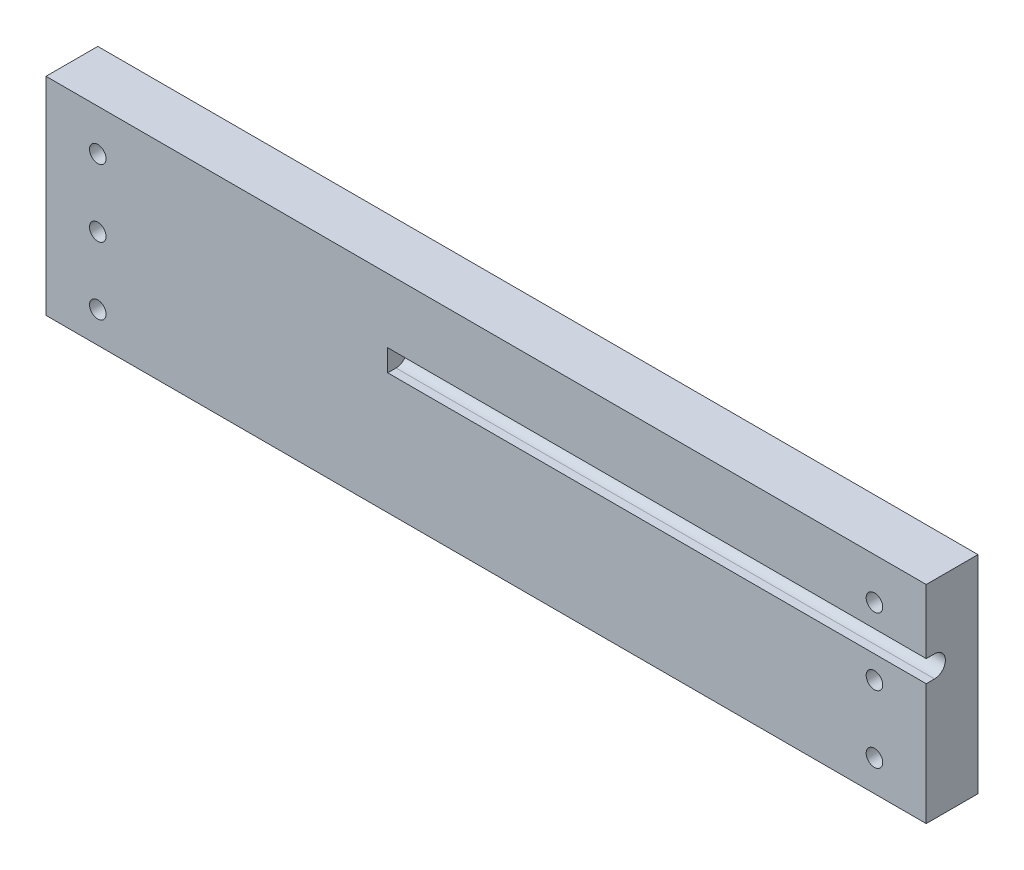
ISO-10303-21;
HEADER;
FILE_DESCRIPTION(('STEP AP214'),'2;1');
FILE_NAME('part.step','',(''),(''),'','','');
FILE_SCHEMA(('AUTOMOTIVE_DESIGN { 1 0 10303 214 1 1 1 1 }'));
ENDSEC;
DATA;
#1=APPLICATION_CONTEXT('core data for automotive mechanical design processes');
#2=APPLICATION_PROTOCOL_DEFINITION('international standard','automotive_design',2000,#1);
#3=PRODUCT_CONTEXT('',#1,'mechanical');
#4=PRODUCT('Part','Part','',(#3));
#5=PRODUCT_RELATED_PRODUCT_CATEGORY('part','',(#4));
#6=PRODUCT_DEFINITION_FORMATION('','',#4);
#7=PRODUCT_DEFINITION_CONTEXT('part definition',#1,'design');
#8=PRODUCT_DEFINITION('design','',#6,#7);
#9=PRODUCT_DEFINITION_SHAPE('','',#8);
#10=(LENGTH_UNIT() NAMED_UNIT(*) SI_UNIT(.MILLI.,.METRE.));
#11=(NAMED_UNIT(*) PLANE_ANGLE_UNIT() SI_UNIT($,.RADIAN.));
#12=(NAMED_UNIT(*) SI_UNIT($,.STERADIAN.) SOLID_ANGLE_UNIT());
#13=UNCERTAINTY_MEASURE_WITH_UNIT(LENGTH_MEASURE(1.E-05),#10,'distance_accuracy_value','');
#14=(GEOMETRIC_REPRESENTATION_CONTEXT(3) GLOBAL_UNCERTAINTY_ASSIGNED_CONTEXT((#13)) GLOBAL_UNIT_ASSIGNED_CONTEXT((#10,
#11,#12)) REPRESENTATION_CONTEXT('',''));
#15=CARTESIAN_POINT('',(0.,0.,0.));
#16=DIRECTION('',(0.,0.,1.));
#17=DIRECTION('',(1.,0.,0.));
#18=AXIS2_PLACEMENT_3D('',#15,#16,#17);
#19=CARTESIAN_POINT('',(-19.,25.5,8.4));
#20=DIRECTION('',(1.,0.,0.));
#21=DIRECTION('',(0.,0.,-1.));
#22=AXIS2_PLACEMENT_3D('',#19,#20,#21);
#23=CYLINDRICAL_SURFACE('',#22,2.1);
#24=CARTESIAN_POINT('',(85.,25.5,8.4));
#25=DIRECTION('',(-1.,0.,0.));
#26=DIRECTION('',(0.,0.,1.));
#27=AXIS2_PLACEMENT_3D('',#24,#25,#26);
#28=CIRCLE('',#27,2.1);
#29=CARTESIAN_POINT('',(85.,27.6,8.4));
#30=VERTEX_POINT('',#29);
#31=CARTESIAN_POINT('',(85.,23.4,8.4));
#32=VERTEX_POINT('',#31);
#33=EDGE_CURVE('E43',#30,#32,#28,.T.);
#34=ORIENTED_EDGE('',*,*,#33,.F.);
#35=DIRECTION('',(1.,0.,0.));
#36=VECTOR('',#35,1.);
#37=CARTESIAN_POINT('',(-23.4944410108488,27.6,8.4));
#38=LINE('',#37,#36);
#39=CARTESIAN_POINT('',(-19.,27.6,8.4));
#40=VERTEX_POINT('',#39);
#41=EDGE_CURVE('E276',#40,#30,#38,.T.);
#42=ORIENTED_EDGE('',*,*,#41,.F.);
#43=CARTESIAN_POINT('',(-19.,25.5,8.4));
#44=DIRECTION('',(1.,0.,0.));
#45=DIRECTION('',(0.,0.,-1.));
#46=AXIS2_PLACEMENT_3D('',#43,#44,#45);
#47=CIRCLE('',#46,2.1);
#48=CARTESIAN_POINT('',(-19.,23.4,8.4));
#49=VERTEX_POINT('',#48);
#50=EDGE_CURVE('E271',#49,#40,#47,.T.);
#51=ORIENTED_EDGE('',*,*,#50,.F.);
#52=DIRECTION('',(1.,0.,0.));
#53=VECTOR('',#52,1.);
#54=CARTESIAN_POINT('',(-23.4944410108488,23.4,8.4));
#55=LINE('',#54,#53);
#56=EDGE_CURVE('E115',#49,#32,#55,.T.);
#57=ORIENTED_EDGE('',*,*,#56,.T.);
#58=EDGE_LOOP('',(#34,#42,#51,#57));
#59=FACE_BOUND('',#58,.T.);
#60=ADVANCED_FACE('F35',(#59),#23,.F.);
#61=CARTESIAN_POINT('',(-85.,0.,10.));
#62=DIRECTION('',(0.,0.,1.));
#63=DIRECTION('',(1.,0.,0.));
#64=AXIS2_PLACEMENT_3D('',#61,#62,#63);
#65=PLANE('',#64);
#66=DIRECTION('',(1.,0.,0.));
#67=VECTOR('',#66,1.);
#68=CARTESIAN_POINT('',(-23.4944410108488,23.4,10.));
#69=LINE('',#68,#67);
#70=CARTESIAN_POINT('',(-19.,23.4,10.));
#71=VERTEX_POINT('',#70);
#72=CARTESIAN_POINT('',(85.,23.4,10.));
#73=VERTEX_POINT('',#72);
#74=EDGE_CURVE('E109',#71,#73,#69,.T.);
#75=ORIENTED_EDGE('',*,*,#74,.F.);
#76=DIRECTION('',(0.,1.,0.));
#77=VECTOR('',#76,1.);
#78=CARTESIAN_POINT('',(-19.,0.,10.));
#79=LINE('',#78,#77);
#80=CARTESIAN_POINT('',(-19.,27.6,10.));
#81=VERTEX_POINT('',#80);
#82=EDGE_CURVE('E11',#71,#81,#79,.T.);
#83=ORIENTED_EDGE('',*,*,#82,.T.);
#84=DIRECTION('',(1.,0.,0.));
#85=VECTOR('',#84,1.);
#86=CARTESIAN_POINT('',(-23.4944410108488,27.6,10.));
#87=LINE('',#86,#85);
#88=CARTESIAN_POINT('',(85.,27.6,10.));
#89=VERTEX_POINT('',#88);
#90=EDGE_CURVE('E278',#81,#89,#87,.T.);
#91=ORIENTED_EDGE('',*,*,#90,.T.);
#92=DIRECTION('',(0.,1.,0.));
#93=VECTOR('',#92,1.);
#94=CARTESIAN_POINT('',(85.,40.,10.));
#95=LINE('',#94,#93);
#96=CARTESIAN_POINT('',(85.,40.,10.));
#97=VERTEX_POINT('',#96);
#98=EDGE_CURVE('E130',#89,#97,#95,.T.);
#99=ORIENTED_EDGE('',*,*,#98,.T.);
#100=DIRECTION('',(-1.,0.,0.));
#101=VECTOR('',#100,1.);
#102=CARTESIAN_POINT('',(-85.,40.,10.));
#103=LINE('',#102,#101);
#104=CARTESIAN_POINT('',(-85.,40.,10.));
#105=VERTEX_POINT('',#104);
#106=EDGE_CURVE('E59',#97,#105,#103,.T.);
#107=ORIENTED_EDGE('',*,*,#106,.T.);
#108=DIRECTION('',(0.,-1.,0.));
#109=VECTOR('',#108,1.);
#110=CARTESIAN_POINT('',(-85.,40.,10.));
#111=LINE('',#110,#109);
#112=CARTESIAN_POINT('',(-85.,0.,10.));
#113=VERTEX_POINT('',#112);
#114=EDGE_CURVE('E146',#105,#113,#111,.T.);
#115=ORIENTED_EDGE('',*,*,#114,.T.);
#116=DIRECTION('',(1.,0.,0.));
#117=VECTOR('',#116,1.);
#118=CARTESIAN_POINT('',(-85.,0.,10.));
#119=LINE('',#118,#117);
#120=CARTESIAN_POINT('',(85.,0.,10.));
#121=VERTEX_POINT('',#120);
#122=EDGE_CURVE('E88',#113,#121,#119,.T.);
#123=ORIENTED_EDGE('',*,*,#122,.T.);
#124=EDGE_CURVE('E124',#121,#73,#95,.T.);
#125=ORIENTED_EDGE('',*,*,#124,.T.);
#126=EDGE_LOOP('',(#75,#83,#91,#99,#107,#115,#123,#125));
#127=FACE_BOUND('',#126,.T.);
#128=CARTESIAN_POINT('',(-75.,19.,10.));
#129=DIRECTION('',(0.,0.,1.));
#130=DIRECTION('',(1.,0.,0.));
#131=AXIS2_PLACEMENT_3D('',#128,#129,#130);
#132=CIRCLE('',#131,1.60000000000001);
#133=CARTESIAN_POINT('',(-73.4,19.,10.));
#134=VERTEX_POINT('',#133);
#135=EDGE_CURVE('E263',#134,#134,#132,.T.);
#136=ORIENTED_EDGE('',*,*,#135,.F.);
#137=EDGE_LOOP('',(#136));
#138=FACE_BOUND('',#137,.T.);
#139=CARTESIAN_POINT('',(75.,6.,10.));
#140=DIRECTION('',(0.,0.,-1.));
#141=DIRECTION('',(-1.,0.,0.));
#142=AXIS2_PLACEMENT_3D('',#139,#140,#141);
#143=CIRCLE('',#142,1.60000000000001);
#144=CARTESIAN_POINT('',(73.4,6.,10.));
#145=VERTEX_POINT('',#144);
#146=EDGE_CURVE('E241',#145,#145,#143,.T.);
#147=ORIENTED_EDGE('',*,*,#146,.T.);
#148=EDGE_LOOP('',(#147));
#149=FACE_BOUND('',#148,.T.);
#150=CARTESIAN_POINT('',(-75.,6.,10.));
#151=DIRECTION('',(0.,0.,1.));
#152=DIRECTION('',(1.,0.,0.));
#153=AXIS2_PLACEMENT_3D('',#150,#151,#152);
#154=CIRCLE('',#153,1.60000000000001);
#155=CARTESIAN_POINT('',(-73.4,6.,10.));
#156=VERTEX_POINT('',#155);
#157=EDGE_CURVE('E245',#156,#156,#154,.T.);
#158=ORIENTED_EDGE('',*,*,#157,.F.);
#159=EDGE_LOOP('',(#158));
#160=FACE_BOUND('',#159,.T.);
#161=CARTESIAN_POINT('',(75.,19.,10.));
#162=DIRECTION('',(0.,0.,-1.));
#163=DIRECTION('',(-1.,0.,0.));
#164=AXIS2_PLACEMENT_3D('',#161,#162,#163);
#165=CIRCLE('',#164,1.60000000000001);
#166=CARTESIAN_POINT('',(73.4,19.,10.));
#167=VERTEX_POINT('',#166);
#168=EDGE_CURVE('E243',#167,#167,#165,.T.);
#169=ORIENTED_EDGE('',*,*,#168,.T.);
#170=EDGE_LOOP('',(#169));
#171=FACE_BOUND('',#170,.T.);
#172=CARTESIAN_POINT('',(75.,32.,10.));
#173=DIRECTION('',(0.,0.,-1.));
#174=DIRECTION('',(-1.,0.,0.));
#175=AXIS2_PLACEMENT_3D('',#172,#173,#174);
#176=CIRCLE('',#175,1.60000000000001);
#177=CARTESIAN_POINT('',(73.4,32.,10.));
#178=VERTEX_POINT('',#177);
#179=EDGE_CURVE('E157',#178,#178,#176,.T.);
#180=ORIENTED_EDGE('',*,*,#179,.T.);
#181=EDGE_LOOP('',(#180));
#182=FACE_BOUND('',#181,.T.);
#183=CARTESIAN_POINT('',(-75.,32.,10.));
#184=DIRECTION('',(0.,0.,1.));
#185=DIRECTION('',(1.,0.,0.));
#186=AXIS2_PLACEMENT_3D('',#183,#184,#185);
#187=CIRCLE('',#186,1.60000000000001);
#188=CARTESIAN_POINT('',(-73.4,32.,10.));
#189=VERTEX_POINT('',#188);
#190=EDGE_CURVE('E163',#189,#189,#187,.T.);
#191=ORIENTED_EDGE('',*,*,#190,.F.);
#192=EDGE_LOOP('',(#191));
#193=FACE_BOUND('',#192,.T.);
#194=ADVANCED_FACE('F128',(#127,#138,#149,#160,#171,#182,#193),#65,.T.);
#195=CARTESIAN_POINT('',(-85.,0.,0.));
#196=DIRECTION('',(0.,0.,1.));
#197=DIRECTION('',(1.,0.,0.));
#198=AXIS2_PLACEMENT_3D('',#195,#196,#197);
#199=PLANE('',#198);
#200=CARTESIAN_POINT('',(-75.,19.,0.));
#201=DIRECTION('',(0.,0.,1.));
#202=DIRECTION('',(1.,0.,0.));
#203=AXIS2_PLACEMENT_3D('',#200,#201,#202);
#204=CIRCLE('',#203,1.60000000000001);
#205=CARTESIAN_POINT('',(-73.4,19.,0.));
#206=VERTEX_POINT('',#205);
#207=EDGE_CURVE('E266',#206,#206,#204,.T.);
#208=ORIENTED_EDGE('',*,*,#207,.T.);
#209=EDGE_LOOP('',(#208));
#210=FACE_BOUND('',#209,.T.);
#211=CARTESIAN_POINT('',(75.,6.,0.));
#212=DIRECTION('',(0.,0.,-1.));
#213=DIRECTION('',(-1.,0.,0.));
#214=AXIS2_PLACEMENT_3D('',#211,#212,#213);
#215=CIRCLE('',#214,1.60000000000001);
#216=CARTESIAN_POINT('',(73.4,6.,0.));
#217=VERTEX_POINT('',#216);
#218=EDGE_CURVE('E238',#217,#217,#215,.T.);
#219=ORIENTED_EDGE('',*,*,#218,.F.);
#220=EDGE_LOOP('',(#219));
#221=FACE_BOUND('',#220,.T.);
#222=CARTESIAN_POINT('',(-75.,6.,0.));
#223=DIRECTION('',(0.,0.,1.));
#224=DIRECTION('',(1.,0.,0.));
#225=AXIS2_PLACEMENT_3D('',#222,#223,#224);
#226=CIRCLE('',#225,1.60000000000001);
#227=CARTESIAN_POINT('',(-73.4,6.,0.));
#228=VERTEX_POINT('',#227);
#229=EDGE_CURVE('E141',#228,#228,#226,.T.);
#230=ORIENTED_EDGE('',*,*,#229,.T.);
#231=EDGE_LOOP('',(#230));
#232=FACE_BOUND('',#231,.T.);
#233=DIRECTION('',(0.,-1.,0.));
#234=VECTOR('',#233,1.);
#235=CARTESIAN_POINT('',(-85.,40.,0.));
#236=LINE('',#235,#234);
#237=CARTESIAN_POINT('',(-85.,40.,0.));
#238=VERTEX_POINT('',#237);
#239=CARTESIAN_POINT('',(-85.,0.,0.));
#240=VERTEX_POINT('',#239);
#241=EDGE_CURVE('E137',#238,#240,#236,.T.);
#242=ORIENTED_EDGE('',*,*,#241,.F.);
#243=DIRECTION('',(-1.,0.,0.));
#244=VECTOR('',#243,1.);
#245=CARTESIAN_POINT('',(-85.,40.,0.));
#246=LINE('',#245,#244);
#247=CARTESIAN_POINT('',(85.,40.,0.));
#248=VERTEX_POINT('',#247);
#249=EDGE_CURVE('E80',#248,#238,#246,.T.);
#250=ORIENTED_EDGE('',*,*,#249,.F.);
#251=DIRECTION('',(0.,1.,0.));
#252=VECTOR('',#251,1.);
#253=CARTESIAN_POINT('',(85.,40.,0.));
#254=LINE('',#253,#252);
#255=CARTESIAN_POINT('',(85.,0.,0.));
#256=VERTEX_POINT('',#255);
#257=EDGE_CURVE('E143',#256,#248,#254,.T.);
#258=ORIENTED_EDGE('',*,*,#257,.F.);
#259=DIRECTION('',(1.,0.,0.));
#260=VECTOR('',#259,1.);
#261=CARTESIAN_POINT('',(-85.,0.,0.));
#262=LINE('',#261,#260);
#263=EDGE_CURVE('E140',#240,#256,#262,.T.);
#264=ORIENTED_EDGE('',*,*,#263,.F.);
#265=EDGE_LOOP('',(#242,#250,#258,#264));
#266=FACE_BOUND('',#265,.T.);
#267=CARTESIAN_POINT('',(75.,19.,0.));
#268=DIRECTION('',(0.,0.,-1.));
#269=DIRECTION('',(-1.,0.,0.));
#270=AXIS2_PLACEMENT_3D('',#267,#268,#269);
#271=CIRCLE('',#270,1.60000000000001);
#272=CARTESIAN_POINT('',(73.4,19.,0.));
#273=VERTEX_POINT('',#272);
#274=EDGE_CURVE('E248',#273,#273,#271,.T.);
#275=ORIENTED_EDGE('',*,*,#274,.F.);
#276=EDGE_LOOP('',(#275));
#277=FACE_BOUND('',#276,.T.);
#278=CARTESIAN_POINT('',(75.,32.,0.));
#279=DIRECTION('',(0.,0.,-1.));
#280=DIRECTION('',(-1.,0.,0.));
#281=AXIS2_PLACEMENT_3D('',#278,#279,#280);
#282=CIRCLE('',#281,1.60000000000001);
#283=CARTESIAN_POINT('',(73.4,32.,0.));
#284=VERTEX_POINT('',#283);
#285=EDGE_CURVE('E154',#284,#284,#282,.T.);
#286=ORIENTED_EDGE('',*,*,#285,.F.);
#287=EDGE_LOOP('',(#286));
#288=FACE_BOUND('',#287,.T.);
#289=CARTESIAN_POINT('',(-75.,32.,0.));
#290=DIRECTION('',(0.,0.,1.));
#291=DIRECTION('',(1.,0.,0.));
#292=AXIS2_PLACEMENT_3D('',#289,#290,#291);
#293=CIRCLE('',#292,1.60000000000001);
#294=CARTESIAN_POINT('',(-73.4,32.,0.));
#295=VERTEX_POINT('',#294);
#296=EDGE_CURVE('E160',#295,#295,#293,.T.);
#297=ORIENTED_EDGE('',*,*,#296,.T.);
#298=EDGE_LOOP('',(#297));
#299=FACE_BOUND('',#298,.T.);
#300=ADVANCED_FACE('F169',(#210,#221,#232,#266,#277,#288,#299),#199,.F.);
#301=CARTESIAN_POINT('',(-85.,40.,10.));
#302=DIRECTION('',(1.,0.,0.));
#303=DIRECTION('',(0.,0.,-1.));
#304=AXIS2_PLACEMENT_3D('',#301,#302,#303);
#305=PLANE('',#304);
#306=ORIENTED_EDGE('',*,*,#241,.T.);
#307=DIRECTION('',(0.,0.,-1.));
#308=VECTOR('',#307,1.);
#309=CARTESIAN_POINT('',(-85.,0.,10.));
#310=LINE('',#309,#308);
#311=EDGE_CURVE('E152',#113,#240,#310,.T.);
#312=ORIENTED_EDGE('',*,*,#311,.F.);
#313=ORIENTED_EDGE('',*,*,#114,.F.);
#314=DIRECTION('',(0.,0.,-1.));
#315=VECTOR('',#314,1.);
#316=CARTESIAN_POINT('',(-85.,40.,10.));
#317=LINE('',#316,#315);
#318=EDGE_CURVE('E132',#105,#238,#317,.T.);
#319=ORIENTED_EDGE('',*,*,#318,.T.);
#320=EDGE_LOOP('',(#306,#312,#313,#319));
#321=FACE_BOUND('',#320,.T.);
#322=ADVANCED_FACE('F175',(#321),#305,.F.);
#323=CARTESIAN_POINT('',(-85.,0.,10.));
#324=DIRECTION('',(0.,1.,0.));
#325=DIRECTION('',(0.,0.,1.));
#326=AXIS2_PLACEMENT_3D('',#323,#324,#325);
#327=PLANE('',#326);
#328=ORIENTED_EDGE('',*,*,#263,.T.);
#329=DIRECTION('',(0.,0.,-1.));
#330=VECTOR('',#329,1.);
#331=CARTESIAN_POINT('',(85.,0.,10.));
#332=LINE('',#331,#330);
#333=EDGE_CURVE('E150',#121,#256,#332,.T.);
#334=ORIENTED_EDGE('',*,*,#333,.F.);
#335=ORIENTED_EDGE('',*,*,#122,.F.);
#336=ORIENTED_EDGE('',*,*,#311,.T.);
#337=EDGE_LOOP('',(#328,#334,#335,#336));
#338=FACE_BOUND('',#337,.T.);
#339=ADVANCED_FACE('F189',(#338),#327,.F.);
#340=CARTESIAN_POINT('',(85.,40.,10.));
#341=DIRECTION('',(-1.,0.,0.));
#342=DIRECTION('',(0.,0.,1.));
#343=AXIS2_PLACEMENT_3D('',#340,#341,#342);
#344=PLANE('',#343);
#345=ORIENTED_EDGE('',*,*,#98,.F.);
#346=DIRECTION('',(0.,0.,1.));
#347=VECTOR('',#346,1.);
#348=CARTESIAN_POINT('',(85.,27.6,10.));
#349=LINE('',#348,#347);
#350=EDGE_CURVE('E116',#30,#89,#349,.T.);
#351=ORIENTED_EDGE('',*,*,#350,.F.);
#352=ORIENTED_EDGE('',*,*,#33,.T.);
#353=DIRECTION('',(0.,0.,-1.));
#354=VECTOR('',#353,1.);
#355=CARTESIAN_POINT('',(85.,23.4,10.));
#356=LINE('',#355,#354);
#357=EDGE_CURVE('E112',#73,#32,#356,.T.);
#358=ORIENTED_EDGE('',*,*,#357,.F.);
#359=ORIENTED_EDGE('',*,*,#124,.F.);
#360=ORIENTED_EDGE('',*,*,#333,.T.);
#361=ORIENTED_EDGE('',*,*,#257,.T.);
#362=DIRECTION('',(0.,0.,-1.));
#363=VECTOR('',#362,1.);
#364=CARTESIAN_POINT('',(85.,40.,10.));
#365=LINE('',#364,#363);
#366=EDGE_CURVE('E148',#97,#248,#365,.T.);
#367=ORIENTED_EDGE('',*,*,#366,.F.);
#368=EDGE_LOOP('',(#345,#351,#352,#358,#359,#360,#361,#367));
#369=FACE_BOUND('',#368,.T.);
#370=ADVANCED_FACE('F122',(#369),#344,.F.);
#371=CARTESIAN_POINT('',(-85.,40.,10.));
#372=DIRECTION('',(0.,-1.,0.));
#373=DIRECTION('',(0.,0.,-1.));
#374=AXIS2_PLACEMENT_3D('',#371,#372,#373);
#375=PLANE('',#374);
#376=ORIENTED_EDGE('',*,*,#249,.T.);
#377=ORIENTED_EDGE('',*,*,#318,.F.);
#378=ORIENTED_EDGE('',*,*,#106,.F.);
#379=ORIENTED_EDGE('',*,*,#366,.T.);
#380=EDGE_LOOP('',(#376,#377,#378,#379));
#381=FACE_BOUND('',#380,.T.);
#382=ADVANCED_FACE('F184',(#381),#375,.F.);
#383=CARTESIAN_POINT('',(-75.,6.,0.));
#384=DIRECTION('',(0.,0.,1.));
#385=DIRECTION('',(1.,0.,0.));
#386=AXIS2_PLACEMENT_3D('',#383,#384,#385);
#387=CYLINDRICAL_SURFACE('',#386,1.60000000000001);
#388=ORIENTED_EDGE('',*,*,#229,.F.);
#389=EDGE_LOOP('',(#388));
#390=FACE_BOUND('',#389,.T.);
#391=ORIENTED_EDGE('',*,*,#157,.T.);
#392=EDGE_LOOP('',(#391));
#393=FACE_BOUND('',#392,.T.);
#394=ADVANCED_FACE('F181',(#390,#393),#387,.F.);
#395=CARTESIAN_POINT('',(75.,6.,0.));
#396=DIRECTION('',(0.,0.,1.));
#397=DIRECTION('',(1.,0.,0.));
#398=AXIS2_PLACEMENT_3D('',#395,#396,#397);
#399=CYLINDRICAL_SURFACE('',#398,1.60000000000001);
#400=ORIENTED_EDGE('',*,*,#218,.T.);
#401=EDGE_LOOP('',(#400));
#402=FACE_BOUND('',#401,.T.);
#403=ORIENTED_EDGE('',*,*,#146,.F.);
#404=EDGE_LOOP('',(#403));
#405=FACE_BOUND('',#404,.T.);
#406=ADVANCED_FACE('F205',(#402,#405),#399,.F.);
#407=CARTESIAN_POINT('',(75.,19.,0.));
#408=DIRECTION('',(0.,0.,1.));
#409=DIRECTION('',(1.,0.,0.));
#410=AXIS2_PLACEMENT_3D('',#407,#408,#409);
#411=CYLINDRICAL_SURFACE('',#410,1.60000000000001);
#412=ORIENTED_EDGE('',*,*,#274,.T.);
#413=EDGE_LOOP('',(#412));
#414=FACE_BOUND('',#413,.T.);
#415=ORIENTED_EDGE('',*,*,#168,.F.);
#416=EDGE_LOOP('',(#415));
#417=FACE_BOUND('',#416,.T.);
#418=ADVANCED_FACE('F197',(#414,#417),#411,.F.);
#419=CARTESIAN_POINT('',(75.,32.,0.));
#420=DIRECTION('',(0.,0.,1.));
#421=DIRECTION('',(1.,0.,0.));
#422=AXIS2_PLACEMENT_3D('',#419,#420,#421);
#423=CYLINDRICAL_SURFACE('',#422,1.60000000000001);
#424=ORIENTED_EDGE('',*,*,#285,.T.);
#425=EDGE_LOOP('',(#424));
#426=FACE_BOUND('',#425,.T.);
#427=ORIENTED_EDGE('',*,*,#179,.F.);
#428=EDGE_LOOP('',(#427));
#429=FACE_BOUND('',#428,.T.);
#430=ADVANCED_FACE('F194',(#426,#429),#423,.F.);
#431=CARTESIAN_POINT('',(-75.,19.,0.));
#432=DIRECTION('',(0.,0.,1.));
#433=DIRECTION('',(1.,0.,0.));
#434=AXIS2_PLACEMENT_3D('',#431,#432,#433);
#435=CYLINDRICAL_SURFACE('',#434,1.60000000000001);
#436=ORIENTED_EDGE('',*,*,#207,.F.);
#437=EDGE_LOOP('',(#436));
#438=FACE_BOUND('',#437,.T.);
#439=ORIENTED_EDGE('',*,*,#135,.T.);
#440=EDGE_LOOP('',(#439));
#441=FACE_BOUND('',#440,.T.);
#442=ADVANCED_FACE('F196',(#438,#441),#435,.F.);
#443=CARTESIAN_POINT('',(-75.,32.,0.));
#444=DIRECTION('',(0.,0.,1.));
#445=DIRECTION('',(1.,0.,0.));
#446=AXIS2_PLACEMENT_3D('',#443,#444,#445);
#447=CYLINDRICAL_SURFACE('',#446,1.60000000000001);
#448=ORIENTED_EDGE('',*,*,#296,.F.);
#449=EDGE_LOOP('',(#448));
#450=FACE_BOUND('',#449,.T.);
#451=ORIENTED_EDGE('',*,*,#190,.T.);
#452=EDGE_LOOP('',(#451));
#453=FACE_BOUND('',#452,.T.);
#454=ADVANCED_FACE('F37',(#450,#453),#447,.F.);
#455=CARTESIAN_POINT('',(-19.,25.5,8.4));
#456=DIRECTION('',(1.,0.,0.));
#457=DIRECTION('',(0.,0.,-1.));
#458=AXIS2_PLACEMENT_3D('',#455,#456,#457);
#459=PLANE('',#458);
#460=ORIENTED_EDGE('',*,*,#50,.T.);
#461=DIRECTION('',(0.,0.,-1.));
#462=VECTOR('',#461,1.);
#463=CARTESIAN_POINT('',(-19.,27.6,10.));
#464=LINE('',#463,#462);
#465=EDGE_CURVE('E273',#81,#40,#464,.T.);
#466=ORIENTED_EDGE('',*,*,#465,.F.);
#467=ORIENTED_EDGE('',*,*,#82,.F.);
#468=DIRECTION('',(0.,0.,1.));
#469=VECTOR('',#468,1.);
#470=CARTESIAN_POINT('',(-19.,23.4,10.));
#471=LINE('',#470,#469);
#472=EDGE_CURVE('E50',#49,#71,#471,.T.);
#473=ORIENTED_EDGE('',*,*,#472,.F.);
#474=EDGE_LOOP('',(#460,#466,#467,#473));
#475=FACE_BOUND('',#474,.T.);
#476=ADVANCED_FACE('F217',(#475),#459,.T.);
#477=CARTESIAN_POINT('',(-23.4944410108488,27.6,10.));
#478=DIRECTION('',(0.,1.,0.));
#479=DIRECTION('',(0.,0.,1.));
#480=AXIS2_PLACEMENT_3D('',#477,#478,#479);
#481=PLANE('',#480);
#482=ORIENTED_EDGE('',*,*,#465,.T.);
#483=ORIENTED_EDGE('',*,*,#41,.T.);
#484=ORIENTED_EDGE('',*,*,#350,.T.);
#485=ORIENTED_EDGE('',*,*,#90,.F.);
#486=EDGE_LOOP('',(#482,#483,#484,#485));
#487=FACE_BOUND('',#486,.T.);
#488=ADVANCED_FACE('F221',(#487),#481,.F.);
#489=CARTESIAN_POINT('',(-23.4944410108488,23.4,10.));
#490=DIRECTION('',(0.,-1.,0.));
#491=DIRECTION('',(0.,0.,-1.));
#492=AXIS2_PLACEMENT_3D('',#489,#490,#491);
#493=PLANE('',#492);
#494=ORIENTED_EDGE('',*,*,#472,.T.);
#495=ORIENTED_EDGE('',*,*,#74,.T.);
#496=ORIENTED_EDGE('',*,*,#357,.T.);
#497=ORIENTED_EDGE('',*,*,#56,.F.);
#498=EDGE_LOOP('',(#494,#495,#496,#497));
#499=FACE_BOUND('',#498,.T.);
#500=ADVANCED_FACE('F111',(#499),#493,.F.);
#501=CLOSED_SHELL('',(#60,#194,#300,#322,#339,#370,#382,#394,#406,#418,#430,#442,#454,#476,#488,#500));
#502=MANIFOLD_SOLID_BREP('B2',#501);
#503=ADVANCED_BREP_SHAPE_REPRESENTATION('',(#18,#502),#14);
#504=SHAPE_DEFINITION_REPRESENTATION(#9,#503);
ENDSEC;
END-ISO-10303-21;
